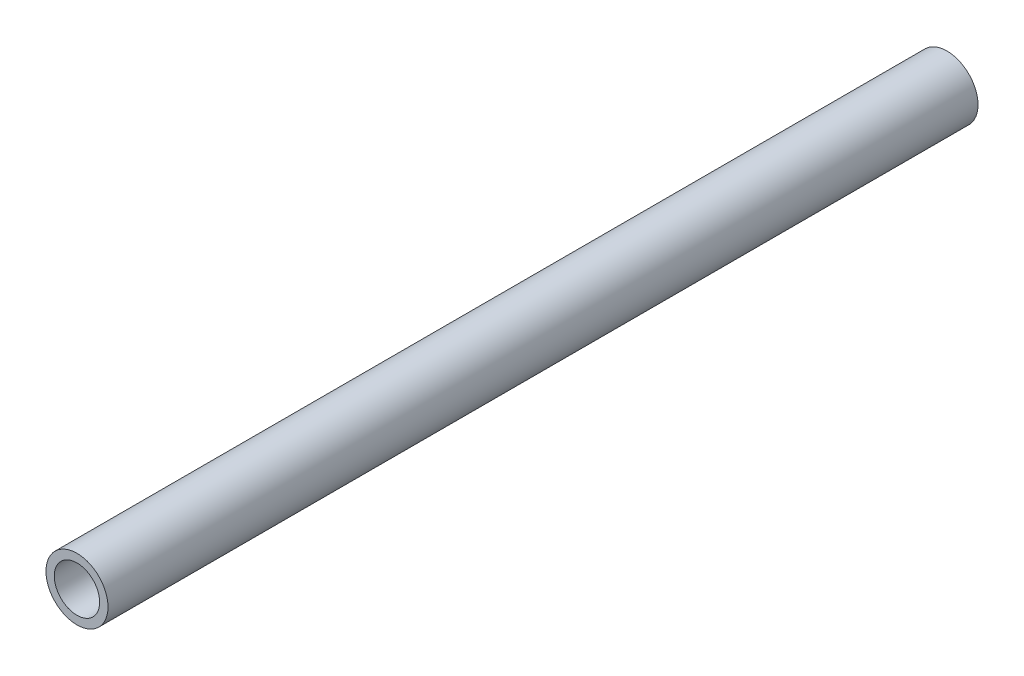
ISO-10303-21;
HEADER;
FILE_DESCRIPTION(('STEP AP214'),'2;1');
FILE_NAME('part.step','',(''),(''),'','','');
FILE_SCHEMA(('AUTOMOTIVE_DESIGN { 1 0 10303 214 1 1 1 1 }'));
ENDSEC;
DATA;
#1=APPLICATION_CONTEXT('core data for automotive mechanical design processes');
#2=APPLICATION_PROTOCOL_DEFINITION('international standard','automotive_design',2000,#1);
#3=PRODUCT_CONTEXT('',#1,'mechanical');
#4=PRODUCT('Part','Part','',(#3));
#5=PRODUCT_RELATED_PRODUCT_CATEGORY('part','',(#4));
#6=PRODUCT_DEFINITION_FORMATION('','',#4);
#7=PRODUCT_DEFINITION_CONTEXT('part definition',#1,'design');
#8=PRODUCT_DEFINITION('design','',#6,#7);
#9=PRODUCT_DEFINITION_SHAPE('','',#8);
#10=(LENGTH_UNIT() NAMED_UNIT(*) SI_UNIT(.MILLI.,.METRE.));
#11=(NAMED_UNIT(*) PLANE_ANGLE_UNIT() SI_UNIT($,.RADIAN.));
#12=(NAMED_UNIT(*) SI_UNIT($,.STERADIAN.) SOLID_ANGLE_UNIT());
#13=UNCERTAINTY_MEASURE_WITH_UNIT(LENGTH_MEASURE(1.E-05),#10,'distance_accuracy_value','');
#14=(GEOMETRIC_REPRESENTATION_CONTEXT(3) GLOBAL_UNCERTAINTY_ASSIGNED_CONTEXT((#13)) GLOBAL_UNIT_ASSIGNED_CONTEXT((#10,
#11,#12)) REPRESENTATION_CONTEXT('',''));
#15=CARTESIAN_POINT('',(0.,0.,0.));
#16=DIRECTION('',(0.,0.,1.));
#17=DIRECTION('',(1.,0.,0.));
#18=AXIS2_PLACEMENT_3D('',#15,#16,#17);
#19=CARTESIAN_POINT('',(0.,0.,150.));
#20=DIRECTION('',(0.,0.,1.));
#21=DIRECTION('',(1.,0.,0.));
#22=AXIS2_PLACEMENT_3D('',#19,#20,#21);
#23=PLANE('',#22);
#24=CARTESIAN_POINT('',(0.,0.,150.));
#25=DIRECTION('',(0.,0.,1.));
#26=DIRECTION('',(1.,0.,0.));
#27=AXIS2_PLACEMENT_3D('',#24,#25,#26);
#28=CIRCLE('',#27,10.7);
#29=CARTESIAN_POINT('',(10.7,0.,150.));
#30=VERTEX_POINT('',#29);
#31=EDGE_CURVE('E10',#30,#30,#28,.T.);
#32=ORIENTED_EDGE('',*,*,#31,.T.);
#33=EDGE_LOOP('',(#32));
#34=FACE_BOUND('',#33,.T.);
#35=CARTESIAN_POINT('',(0.,0.,150.));
#36=DIRECTION('',(0.,0.,1.));
#37=DIRECTION('',(1.,0.,0.));
#38=AXIS2_PLACEMENT_3D('',#35,#36,#37);
#39=CIRCLE('',#38,7.825);
#40=CARTESIAN_POINT('',(7.825,0.,150.));
#41=VERTEX_POINT('',#40);
#42=EDGE_CURVE('E43',#41,#41,#39,.T.);
#43=ORIENTED_EDGE('',*,*,#42,.F.);
#44=EDGE_LOOP('',(#43));
#45=FACE_BOUND('',#44,.T.);
#46=ADVANCED_FACE('F32',(#34,#45),#23,.T.);
#47=CARTESIAN_POINT('',(0.,0.,-150.));
#48=DIRECTION('',(0.,0.,1.));
#49=DIRECTION('',(1.,0.,0.));
#50=AXIS2_PLACEMENT_3D('',#47,#48,#49);
#51=PLANE('',#50);
#52=CARTESIAN_POINT('',(0.,0.,-150.));
#53=DIRECTION('',(0.,0.,1.));
#54=DIRECTION('',(1.,0.,0.));
#55=AXIS2_PLACEMENT_3D('',#52,#53,#54);
#56=CIRCLE('',#55,10.7);
#57=CARTESIAN_POINT('',(10.7,0.,-150.));
#58=VERTEX_POINT('',#57);
#59=EDGE_CURVE('E36',#58,#58,#56,.T.);
#60=ORIENTED_EDGE('',*,*,#59,.F.);
#61=EDGE_LOOP('',(#60));
#62=FACE_BOUND('',#61,.T.);
#63=CARTESIAN_POINT('',(0.,0.,-150.));
#64=DIRECTION('',(0.,0.,1.));
#65=DIRECTION('',(1.,0.,0.));
#66=AXIS2_PLACEMENT_3D('',#63,#64,#65);
#67=CIRCLE('',#66,7.825);
#68=CARTESIAN_POINT('',(7.825,0.,-150.));
#69=VERTEX_POINT('',#68);
#70=EDGE_CURVE('E45',#69,#69,#67,.T.);
#71=ORIENTED_EDGE('',*,*,#70,.T.);
#72=EDGE_LOOP('',(#71));
#73=FACE_BOUND('',#72,.T.);
#74=ADVANCED_FACE('F55',(#62,#73),#51,.F.);
#75=CARTESIAN_POINT('',(0.,0.,150.));
#76=DIRECTION('',(0.,0.,-1.));
#77=DIRECTION('',(-1.,0.,0.));
#78=AXIS2_PLACEMENT_3D('',#75,#76,#77);
#79=CYLINDRICAL_SURFACE('',#78,10.7);
#80=ORIENTED_EDGE('',*,*,#31,.F.);
#81=EDGE_LOOP('',(#80));
#82=FACE_BOUND('',#81,.T.);
#83=ORIENTED_EDGE('',*,*,#59,.T.);
#84=EDGE_LOOP('',(#83));
#85=FACE_BOUND('',#84,.T.);
#86=ADVANCED_FACE('F34',(#82,#85),#79,.T.);
#87=CARTESIAN_POINT('',(0.,0.,150.));
#88=DIRECTION('',(0.,0.,-1.));
#89=DIRECTION('',(-1.,0.,0.));
#90=AXIS2_PLACEMENT_3D('',#87,#88,#89);
#91=CYLINDRICAL_SURFACE('',#90,7.825);
#92=ORIENTED_EDGE('',*,*,#42,.T.);
#93=EDGE_LOOP('',(#92));
#94=FACE_BOUND('',#93,.T.);
#95=ORIENTED_EDGE('',*,*,#70,.F.);
#96=EDGE_LOOP('',(#95));
#97=FACE_BOUND('',#96,.T.);
#98=ADVANCED_FACE('F51',(#94,#97),#91,.F.);
#99=CLOSED_SHELL('',(#46,#74,#86,#98));
#100=MANIFOLD_SOLID_BREP('B2',#99);
#101=ADVANCED_BREP_SHAPE_REPRESENTATION('',(#18,#100),#14);
#102=SHAPE_DEFINITION_REPRESENTATION(#9,#101);
ENDSEC;
END-ISO-10303-21;
